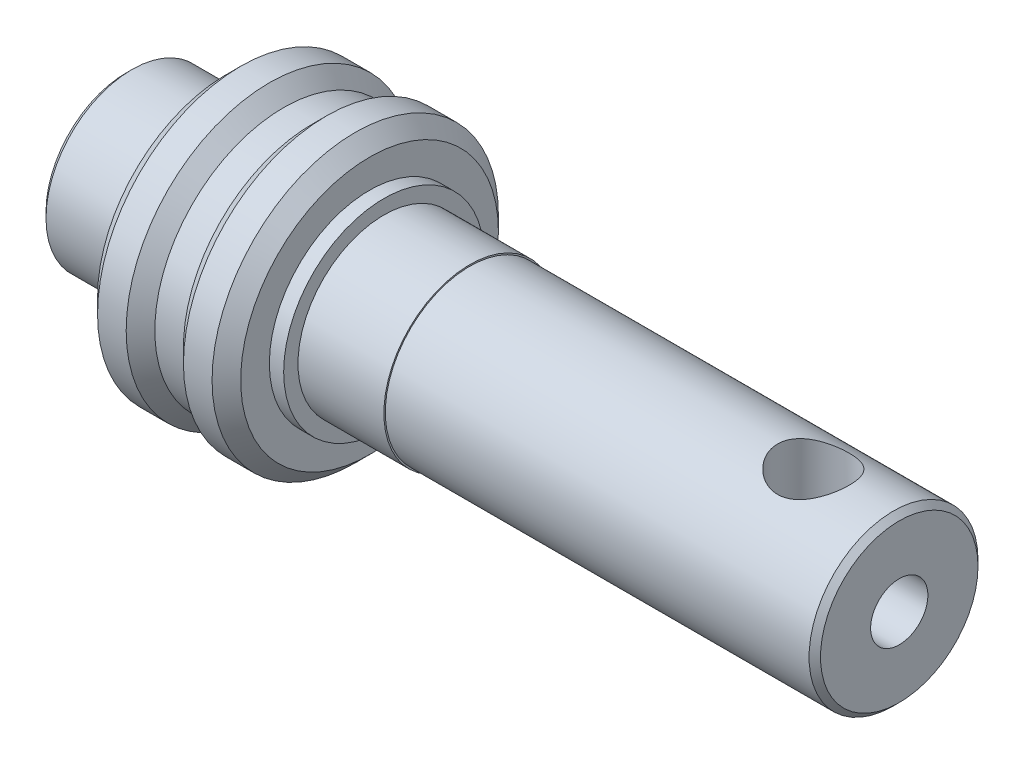
ISO-10303-21;
HEADER;
FILE_DESCRIPTION(('STEP AP214'),'2;1');
FILE_NAME('part.step','',(''),(''),'','','');
FILE_SCHEMA(('AUTOMOTIVE_DESIGN { 1 0 10303 214 1 1 1 1 }'));
ENDSEC;
DATA;
#1=APPLICATION_CONTEXT('core data for automotive mechanical design processes');
#2=APPLICATION_PROTOCOL_DEFINITION('international standard','automotive_design',2000,#1);
#3=PRODUCT_CONTEXT('',#1,'mechanical');
#4=PRODUCT('Part','Part','',(#3));
#5=PRODUCT_RELATED_PRODUCT_CATEGORY('part','',(#4));
#6=PRODUCT_DEFINITION_FORMATION('','',#4);
#7=PRODUCT_DEFINITION_CONTEXT('part definition',#1,'design');
#8=PRODUCT_DEFINITION('design','',#6,#7);
#9=PRODUCT_DEFINITION_SHAPE('','',#8);
#10=(LENGTH_UNIT() NAMED_UNIT(*) SI_UNIT(.MILLI.,.METRE.));
#11=(NAMED_UNIT(*) PLANE_ANGLE_UNIT() SI_UNIT($,.RADIAN.));
#12=(NAMED_UNIT(*) SI_UNIT($,.STERADIAN.) SOLID_ANGLE_UNIT());
#13=UNCERTAINTY_MEASURE_WITH_UNIT(LENGTH_MEASURE(1.E-05),#10,'distance_accuracy_value','');
#14=(GEOMETRIC_REPRESENTATION_CONTEXT(3) GLOBAL_UNCERTAINTY_ASSIGNED_CONTEXT((#13)) GLOBAL_UNIT_ASSIGNED_CONTEXT((#10,
#11,#12)) REPRESENTATION_CONTEXT('',''));
#15=CARTESIAN_POINT('',(0.,0.,0.));
#16=DIRECTION('',(0.,0.,1.));
#17=DIRECTION('',(1.,0.,0.));
#18=AXIS2_PLACEMENT_3D('',#15,#16,#17);
#19=CARTESIAN_POINT('',(-3.,3.,0.));
#20=DIRECTION('',(-1.,0.,0.));
#21=DIRECTION('',(0.,0.,1.));
#22=AXIS2_PLACEMENT_3D('',#19,#20,#21);
#23=PLANE('',#22);
#24=CARTESIAN_POINT('',(-3.,0.,0.));
#25=DIRECTION('',(1.,0.,0.));
#26=DIRECTION('',(0.,0.,-1.));
#27=AXIS2_PLACEMENT_3D('',#24,#25,#26);
#28=CIRCLE('',#27,3.);
#29=CARTESIAN_POINT('',(-3.,0.,-3.));
#30=VERTEX_POINT('',#29);
#31=EDGE_CURVE('E165',#30,#30,#28,.T.);
#32=ORIENTED_EDGE('',*,*,#31,.T.);
#33=EDGE_LOOP('',(#32));
#34=FACE_BOUND('',#33,.T.);
#35=CARTESIAN_POINT('',(-3.,0.,0.));
#36=DIRECTION('',(1.,0.,0.));
#37=DIRECTION('',(0.,0.,-1.));
#38=AXIS2_PLACEMENT_3D('',#35,#36,#37);
#39=CIRCLE('',#38,3.5);
#40=CARTESIAN_POINT('',(-3.,0.,-3.5));
#41=VERTEX_POINT('',#40);
#42=EDGE_CURVE('E126',#41,#41,#39,.T.);
#43=ORIENTED_EDGE('',*,*,#42,.F.);
#44=EDGE_LOOP('',(#43));
#45=FACE_BOUND('',#44,.T.);
#46=ADVANCED_FACE('F37',(#34,#45),#23,.T.);
#47=CARTESIAN_POINT('',(-5.51877622836158,0.,0.));
#48=DIRECTION('',(1.,0.,0.));
#49=DIRECTION('',(0.,0.,-1.));
#50=AXIS2_PLACEMENT_3D('',#47,#48,#49);
#51=CYLINDRICAL_SURFACE('',#50,3.5);
#52=ORIENTED_EDGE('',*,*,#42,.T.);
#53=EDGE_LOOP('',(#52));
#54=FACE_BOUND('',#53,.T.);
#55=CARTESIAN_POINT('',(-2.5,0.,0.));
#56=DIRECTION('',(1.,0.,0.));
#57=DIRECTION('',(0.,0.,-1.));
#58=AXIS2_PLACEMENT_3D('',#55,#56,#57);
#59=CIRCLE('',#58,3.5);
#60=CARTESIAN_POINT('',(-2.5,0.,-3.5));
#61=VERTEX_POINT('',#60);
#62=EDGE_CURVE('E129',#61,#61,#59,.T.);
#63=ORIENTED_EDGE('',*,*,#62,.F.);
#64=EDGE_LOOP('',(#63));
#65=FACE_BOUND('',#64,.T.);
#66=ADVANCED_FACE('F222',(#54,#65),#51,.T.);
#67=CARTESIAN_POINT('',(-2.5,3.5,0.));
#68=DIRECTION('',(-1.,0.,0.));
#69=DIRECTION('',(0.,0.,1.));
#70=AXIS2_PLACEMENT_3D('',#67,#68,#69);
#71=PLANE('',#70);
#72=CARTESIAN_POINT('',(-2.5,0.,0.));
#73=DIRECTION('',(-1.,0.,0.));
#74=DIRECTION('',(0.,0.,1.));
#75=AXIS2_PLACEMENT_3D('',#72,#73,#74);
#76=CIRCLE('',#75,4.5);
#77=CARTESIAN_POINT('',(-2.5,0.,4.5));
#78=VERTEX_POINT('',#77);
#79=EDGE_CURVE('E111',#78,#78,#76,.T.);
#80=ORIENTED_EDGE('',*,*,#79,.T.);
#81=EDGE_LOOP('',(#80));
#82=FACE_BOUND('',#81,.T.);
#83=ORIENTED_EDGE('',*,*,#62,.T.);
#84=EDGE_LOOP('',(#83));
#85=FACE_BOUND('',#84,.T.);
#86=ADVANCED_FACE('F218',(#82,#85),#71,.T.);
#87=CARTESIAN_POINT('',(-5.51877622836158,0.,0.));
#88=DIRECTION('',(1.,0.,0.));
#89=DIRECTION('',(0.,0.,-1.));
#90=AXIS2_PLACEMENT_3D('',#87,#88,#89);
#91=CYLINDRICAL_SURFACE('',#90,5.);
#92=CARTESIAN_POINT('',(-2.,0.,0.));
#93=DIRECTION('',(-1.,0.,0.));
#94=DIRECTION('',(0.,0.,1.));
#95=AXIS2_PLACEMENT_3D('',#92,#93,#94);
#96=CIRCLE('',#95,5.);
#97=CARTESIAN_POINT('',(-2.,0.,5.));
#98=VERTEX_POINT('',#97);
#99=EDGE_CURVE('E117',#98,#98,#96,.F.);
#100=ORIENTED_EDGE('',*,*,#99,.T.);
#101=EDGE_LOOP('',(#100));
#102=FACE_BOUND('',#101,.T.);
#103=CARTESIAN_POINT('',(-1.,0.,0.));
#104=DIRECTION('',(1.,0.,0.));
#105=DIRECTION('',(0.,0.,-1.));
#106=AXIS2_PLACEMENT_3D('',#103,#104,#105);
#107=CIRCLE('',#106,5.);
#108=CARTESIAN_POINT('',(-1.,0.,-5.));
#109=VERTEX_POINT('',#108);
#110=EDGE_CURVE('E132',#109,#109,#107,.T.);
#111=ORIENTED_EDGE('',*,*,#110,.F.);
#112=EDGE_LOOP('',(#111));
#113=FACE_BOUND('',#112,.T.);
#114=ADVANCED_FACE('F214',(#102,#113),#91,.T.);
#115=CARTESIAN_POINT('',(-0.5,0.,0.));
#116=DIRECTION('',(-1.,0.,0.));
#117=DIRECTION('',(0.,0.,1.));
#118=AXIS2_PLACEMENT_3D('',#115,#116,#117);
#119=CONICAL_SURFACE('',#118,4.5,0.785398163397448);
#120=ORIENTED_EDGE('',*,*,#110,.T.);
#121=EDGE_LOOP('',(#120));
#122=FACE_BOUND('',#121,.T.);
#123=CARTESIAN_POINT('',(-0.5,0.,0.));
#124=DIRECTION('',(1.,0.,0.));
#125=DIRECTION('',(0.,0.,-1.));
#126=AXIS2_PLACEMENT_3D('',#123,#124,#125);
#127=CIRCLE('',#126,4.5);
#128=CARTESIAN_POINT('',(-0.5,0.,-4.5));
#129=VERTEX_POINT('',#128);
#130=EDGE_CURVE('E135',#129,#129,#127,.T.);
#131=ORIENTED_EDGE('',*,*,#130,.F.);
#132=EDGE_LOOP('',(#131));
#133=FACE_BOUND('',#132,.T.);
#134=ADVANCED_FACE('F210',(#122,#133),#119,.T.);
#135=CARTESIAN_POINT('',(-5.51877622836158,0.,0.));
#136=DIRECTION('',(1.,0.,0.));
#137=DIRECTION('',(0.,0.,-1.));
#138=AXIS2_PLACEMENT_3D('',#135,#136,#137);
#139=CYLINDRICAL_SURFACE('',#138,4.5);
#140=ORIENTED_EDGE('',*,*,#130,.T.);
#141=EDGE_LOOP('',(#140));
#142=FACE_BOUND('',#141,.T.);
#143=CARTESIAN_POINT('',(0.5,0.,0.));
#144=DIRECTION('',(1.,0.,0.));
#145=DIRECTION('',(0.,0.,-1.));
#146=AXIS2_PLACEMENT_3D('',#143,#144,#145);
#147=CIRCLE('',#146,4.5);
#148=CARTESIAN_POINT('',(0.5,0.,-4.5));
#149=VERTEX_POINT('',#148);
#150=EDGE_CURVE('E138',#149,#149,#147,.T.);
#151=ORIENTED_EDGE('',*,*,#150,.F.);
#152=EDGE_LOOP('',(#151));
#153=FACE_BOUND('',#152,.T.);
#154=ADVANCED_FACE('F206',(#142,#153),#139,.T.);
#155=CARTESIAN_POINT('',(1.,0.,0.));
#156=DIRECTION('',(1.,0.,0.));
#157=DIRECTION('',(0.,0.,-1.));
#158=AXIS2_PLACEMENT_3D('',#155,#156,#157);
#159=CONICAL_SURFACE('',#158,5.,0.785398163397448);
#160=ORIENTED_EDGE('',*,*,#150,.T.);
#161=EDGE_LOOP('',(#160));
#162=FACE_BOUND('',#161,.T.);
#163=CARTESIAN_POINT('',(1.,0.,0.));
#164=DIRECTION('',(1.,0.,0.));
#165=DIRECTION('',(0.,0.,-1.));
#166=AXIS2_PLACEMENT_3D('',#163,#164,#165);
#167=CIRCLE('',#166,5.);
#168=CARTESIAN_POINT('',(1.,0.,-5.));
#169=VERTEX_POINT('',#168);
#170=EDGE_CURVE('E141',#169,#169,#167,.T.);
#171=ORIENTED_EDGE('',*,*,#170,.F.);
#172=EDGE_LOOP('',(#171));
#173=FACE_BOUND('',#172,.T.);
#174=ADVANCED_FACE('F202',(#162,#173),#159,.T.);
#175=CARTESIAN_POINT('',(-5.51877622836158,0.,0.));
#176=DIRECTION('',(1.,0.,0.));
#177=DIRECTION('',(0.,0.,-1.));
#178=AXIS2_PLACEMENT_3D('',#175,#176,#177);
#179=CYLINDRICAL_SURFACE('',#178,5.);
#180=CARTESIAN_POINT('',(2.,0.,0.));
#181=DIRECTION('',(1.,0.,0.));
#182=DIRECTION('',(0.,0.,-1.));
#183=AXIS2_PLACEMENT_3D('',#180,#181,#182);
#184=CIRCLE('',#183,5.);
#185=CARTESIAN_POINT('',(2.,0.,-5.));
#186=VERTEX_POINT('',#185);
#187=EDGE_CURVE('E120',#186,#186,#184,.F.);
#188=ORIENTED_EDGE('',*,*,#187,.T.);
#189=EDGE_LOOP('',(#188));
#190=FACE_BOUND('',#189,.T.);
#191=ORIENTED_EDGE('',*,*,#170,.T.);
#192=EDGE_LOOP('',(#191));
#193=FACE_BOUND('',#192,.T.);
#194=ADVANCED_FACE('F198',(#190,#193),#179,.T.);
#195=CARTESIAN_POINT('',(2.5,3.5,0.));
#196=DIRECTION('',(1.,0.,0.));
#197=DIRECTION('',(0.,0.,-1.));
#198=AXIS2_PLACEMENT_3D('',#195,#196,#197);
#199=PLANE('',#198);
#200=CARTESIAN_POINT('',(2.5,0.,0.));
#201=DIRECTION('',(1.,0.,0.));
#202=DIRECTION('',(0.,0.,-1.));
#203=AXIS2_PLACEMENT_3D('',#200,#201,#202);
#204=CIRCLE('',#203,4.5);
#205=CARTESIAN_POINT('',(2.5,0.,-4.5));
#206=VERTEX_POINT('',#205);
#207=EDGE_CURVE('E123',#206,#206,#204,.T.);
#208=ORIENTED_EDGE('',*,*,#207,.T.);
#209=EDGE_LOOP('',(#208));
#210=FACE_BOUND('',#209,.T.);
#211=CARTESIAN_POINT('',(2.5,0.,0.));
#212=DIRECTION('',(1.,0.,0.));
#213=DIRECTION('',(0.,0.,-1.));
#214=AXIS2_PLACEMENT_3D('',#211,#212,#213);
#215=CIRCLE('',#214,3.5);
#216=CARTESIAN_POINT('',(2.5,0.,-3.5));
#217=VERTEX_POINT('',#216);
#218=EDGE_CURVE('E144',#217,#217,#215,.T.);
#219=ORIENTED_EDGE('',*,*,#218,.F.);
#220=EDGE_LOOP('',(#219));
#221=FACE_BOUND('',#220,.T.);
#222=ADVANCED_FACE('F194',(#210,#221),#199,.T.);
#223=CARTESIAN_POINT('',(-5.51877622836158,0.,0.));
#224=DIRECTION('',(1.,0.,0.));
#225=DIRECTION('',(0.,0.,-1.));
#226=AXIS2_PLACEMENT_3D('',#223,#224,#225);
#227=CYLINDRICAL_SURFACE('',#226,3.5);
#228=ORIENTED_EDGE('',*,*,#218,.T.);
#229=EDGE_LOOP('',(#228));
#230=FACE_BOUND('',#229,.T.);
#231=CARTESIAN_POINT('',(3.,0.,0.));
#232=DIRECTION('',(1.,0.,0.));
#233=DIRECTION('',(0.,0.,-1.));
#234=AXIS2_PLACEMENT_3D('',#231,#232,#233);
#235=CIRCLE('',#234,3.5);
#236=CARTESIAN_POINT('',(3.,0.,-3.5));
#237=VERTEX_POINT('',#236);
#238=EDGE_CURVE('E147',#237,#237,#235,.T.);
#239=ORIENTED_EDGE('',*,*,#238,.F.);
#240=EDGE_LOOP('',(#239));
#241=FACE_BOUND('',#240,.T.);
#242=ADVANCED_FACE('F190',(#230,#241),#227,.T.);
#243=CARTESIAN_POINT('',(3.,3.,0.));
#244=DIRECTION('',(1.,0.,0.));
#245=DIRECTION('',(0.,0.,-1.));
#246=AXIS2_PLACEMENT_3D('',#243,#244,#245);
#247=PLANE('',#246);
#248=ORIENTED_EDGE('',*,*,#238,.T.);
#249=EDGE_LOOP('',(#248));
#250=FACE_BOUND('',#249,.T.);
#251=CARTESIAN_POINT('',(3.,0.,0.));
#252=DIRECTION('',(1.,0.,0.));
#253=DIRECTION('',(0.,0.,-1.));
#254=AXIS2_PLACEMENT_3D('',#251,#252,#253);
#255=CIRCLE('',#254,3.);
#256=CARTESIAN_POINT('',(3.,0.,-3.));
#257=VERTEX_POINT('',#256);
#258=EDGE_CURVE('E150',#257,#257,#255,.T.);
#259=ORIENTED_EDGE('',*,*,#258,.F.);
#260=EDGE_LOOP('',(#259));
#261=FACE_BOUND('',#260,.T.);
#262=ADVANCED_FACE('F186',(#250,#261),#247,.T.);
#263=CARTESIAN_POINT('',(-5.51877622836158,0.,0.));
#264=DIRECTION('',(1.,0.,0.));
#265=DIRECTION('',(0.,0.,-1.));
#266=AXIS2_PLACEMENT_3D('',#263,#264,#265);
#267=CYLINDRICAL_SURFACE('',#266,3.);
#268=ORIENTED_EDGE('',*,*,#258,.T.);
#269=EDGE_LOOP('',(#268));
#270=FACE_BOUND('',#269,.T.);
#271=CARTESIAN_POINT('',(6.,0.,0.));
#272=DIRECTION('',(1.,0.,0.));
#273=DIRECTION('',(0.,0.,-1.));
#274=AXIS2_PLACEMENT_3D('',#271,#272,#273);
#275=CIRCLE('',#274,3.);
#276=CARTESIAN_POINT('',(6.,0.,-3.));
#277=VERTEX_POINT('',#276);
#278=EDGE_CURVE('E153',#277,#277,#275,.T.);
#279=ORIENTED_EDGE('',*,*,#278,.F.);
#280=EDGE_LOOP('',(#279));
#281=FACE_BOUND('',#280,.T.);
#282=ADVANCED_FACE('F182',(#270,#281),#267,.T.);
#283=CARTESIAN_POINT('',(6.,3.,0.));
#284=DIRECTION('',(1.,0.,0.));
#285=DIRECTION('',(0.,0.,-1.));
#286=AXIS2_PLACEMENT_3D('',#283,#284,#285);
#287=PLANE('',#286);
#288=ORIENTED_EDGE('',*,*,#278,.T.);
#289=EDGE_LOOP('',(#288));
#290=FACE_BOUND('',#289,.T.);
#291=CARTESIAN_POINT('',(6.,0.,0.));
#292=DIRECTION('',(1.,0.,0.));
#293=DIRECTION('',(0.,0.,-1.));
#294=AXIS2_PLACEMENT_3D('',#291,#292,#293);
#295=CIRCLE('',#294,2.95);
#296=CARTESIAN_POINT('',(6.,0.,-2.95));
#297=VERTEX_POINT('',#296);
#298=EDGE_CURVE('E156',#297,#297,#295,.T.);
#299=ORIENTED_EDGE('',*,*,#298,.F.);
#300=EDGE_LOOP('',(#299));
#301=FACE_BOUND('',#300,.T.);
#302=ADVANCED_FACE('F178',(#290,#301),#287,.T.);
#303=CARTESIAN_POINT('',(-5.51877622836158,0.,0.));
#304=DIRECTION('',(1.,0.,0.));
#305=DIRECTION('',(0.,0.,-1.));
#306=AXIS2_PLACEMENT_3D('',#303,#304,#305);
#307=CYLINDRICAL_SURFACE('',#306,2.95);
#308=CARTESIAN_POINT('',(20.8,0.,0.));
#309=DIRECTION('',(1.,0.,0.));
#310=DIRECTION('',(0.,0.,-1.));
#311=AXIS2_PLACEMENT_3D('',#308,#309,#310);
#312=CIRCLE('',#311,2.95);
#313=CARTESIAN_POINT('',(20.8,0.,-2.95));
#314=VERTEX_POINT('',#313);
#315=EDGE_CURVE('E82',#314,#314,#312,.F.);
#316=ORIENTED_EDGE('',*,*,#315,.T.);
#317=EDGE_LOOP('',(#316));
#318=FACE_BOUND('',#317,.T.);
#319=CARTESIAN_POINT('',(18.,2.67207784317748,1.25));
#320=CARTESIAN_POINT('',(18.0665552583669,2.67208548535067,1.2499922049137));
#321=CARTESIAN_POINT('',(18.1332143552284,2.67460083245179,1.24465078997766));
#322=CARTESIAN_POINT('',(18.2646017748847,2.68434099538183,1.22349475548766));
#323=CARTESIAN_POINT('',(18.3293244535233,2.69157839586132,1.20765214761075));
#324=CARTESIAN_POINT('',(18.4546979243511,2.70978171460301,1.16622843052234));
#325=CARTESIAN_POINT('',(18.5153644763384,2.72073206042404,1.14068794236819));
#326=CARTESIAN_POINT('',(18.6315348578278,2.74510530380813,1.08071294797428));
#327=CARTESIAN_POINT('',(18.6870397823873,2.75852767511306,1.04628033411194));
#328=CARTESIAN_POINT('',(18.7949185251702,2.7872988114418,0.967128190521415));
#329=CARTESIAN_POINT('',(18.8469200256668,2.80271430595523,0.921925236300558));
#330=CARTESIAN_POINT('',(18.9428805867829,2.83318723945733,0.823529939056352));
#331=CARTESIAN_POINT('',(18.9868364841508,2.84824453559925,0.770334468556174));
#332=CARTESIAN_POINT('',(19.0673801778458,2.87712035476398,0.654517555720196));
#333=CARTESIAN_POINT('',(19.1035459596839,2.89085231221359,0.591579077109848));
#334=CARTESIAN_POINT('',(19.1646143967269,2.91470979722037,0.459824082234821));
#335=CARTESIAN_POINT('',(19.1895222138995,2.92483697717571,0.391010277150106));
#336=CARTESIAN_POINT('',(19.2260086602687,2.93987005428562,0.253370030703841));
#337=CARTESIAN_POINT('',(19.2382301665857,2.94502671403674,0.184741960276691));
#338=CARTESIAN_POINT('',(19.2510774958484,2.950450589839,0.0462285265928651));
#339=CARTESIAN_POINT('',(19.2517081927168,2.95071986103111,-0.0236562958261174));
#340=CARTESIAN_POINT('',(19.2416860476922,2.94648407675087,-0.158012999343338));
#341=CARTESIAN_POINT('',(19.2317404430642,2.94227826022061,-0.222548862051797));
#342=CARTESIAN_POINT('',(19.2020644877658,2.92997909464513,-0.348934785017122));
#343=CARTESIAN_POINT('',(19.1823334146408,2.92188545856613,-0.410784646601553));
#344=CARTESIAN_POINT('',(19.1334165217714,2.90243404698298,-0.531183115927093));
#345=CARTESIAN_POINT('',(19.1040907245077,2.89102824566175,-0.589666771993098));
#346=CARTESIAN_POINT('',(19.0369568874454,2.86606172043506,-0.701036573450896));
#347=CARTESIAN_POINT('',(18.9991458189152,2.85250022758277,-0.753920710206181));
#348=CARTESIAN_POINT('',(18.9129275966787,2.82341527980689,-0.856668382156696));
#349=CARTESIAN_POINT('',(18.8639507332495,2.8078208654667,-0.906034453762614));
#350=CARTESIAN_POINT('',(18.7583903834587,2.77715815894928,-0.996072089759583));
#351=CARTESIAN_POINT('',(18.70180377389,2.76209008600989,-1.03674006641414));
#352=CARTESIAN_POINT('',(18.5801375697692,2.73366918745537,-1.10956655336745));
#353=CARTESIAN_POINT('',(18.5148301733271,2.72039477203299,-1.14137774966339));
#354=CARTESIAN_POINT('',(18.3790739590318,2.69800578399533,-1.19334609168722));
#355=CARTESIAN_POINT('',(18.3086290075598,2.6888881198425,-1.21351190152856));
#356=CARTESIAN_POINT('',(18.1695884325072,2.67661922069407,-1.24032829689829));
#357=CARTESIAN_POINT('',(18.1011808244416,2.67311187366277,-1.24778770337611));
#358=CARTESIAN_POINT('',(17.9640161040773,2.67144148789443,-1.2513620247367));
#359=CARTESIAN_POINT('',(17.8952591289519,2.67327649239418,-1.24748109328585));
#360=CARTESIAN_POINT('',(17.7642207817356,2.68171511685599,-1.22922365861625));
#361=CARTESIAN_POINT('',(17.7018147611092,2.68798996937048,-1.21557004917217));
#362=CARTESIAN_POINT('',(17.580235319636,2.70417583747824,-1.17912156239001));
#363=CARTESIAN_POINT('',(17.521062675582,2.71408772246522,-1.15632449928582));
#364=CARTESIAN_POINT('',(17.4047807878813,2.73694942917907,-1.10115090717702));
#365=CARTESIAN_POINT('',(17.3478699417011,2.75001163483625,-1.0684043349607));
#366=CARTESIAN_POINT('',(17.2400715814243,2.77754742295918,-0.994625199744154));
#367=CARTESIAN_POINT('',(17.1891867520393,2.79202162930138,-0.953588965398221));
#368=CARTESIAN_POINT('',(17.0903947099677,2.8222303185641,-0.860299187462321));
#369=CARTESIAN_POINT('',(17.0431052438998,2.83796765727313,-0.807389755242747));
#370=CARTESIAN_POINT('',(16.9579585708419,2.86779660988328,-0.694027617496358));
#371=CARTESIAN_POINT('',(16.920102201652,2.88188807754742,-0.633574242669689));
#372=CARTESIAN_POINT('',(16.8548892547958,2.90695144238243,-0.506310415126907));
#373=CARTESIAN_POINT('',(16.8275744033031,2.91791089870723,-0.439475979640258));
#374=CARTESIAN_POINT('',(16.784781709034,2.93536539250821,-0.301575081448981));
#375=CARTESIAN_POINT('',(16.7692965536228,2.94186318774924,-0.23051126251259));
#376=CARTESIAN_POINT('',(16.7515464562631,2.94933522185492,-0.0916803580334515));
#377=CARTESIAN_POINT('',(16.7484114348714,2.95067284567154,-0.0240433567641549));
#378=CARTESIAN_POINT('',(16.7530934312401,2.94868965670047,0.110773206146074));
#379=CARTESIAN_POINT('',(16.7609084109025,2.94536971081511,0.177952850575297));
#380=CARTESIAN_POINT('',(16.7866439055202,2.93463872479055,0.307337230514564));
#381=CARTESIAN_POINT('',(16.8041732048366,2.92738628418558,0.3696340452496));
#382=CARTESIAN_POINT('',(16.8484053838091,2.90959814984794,0.490373349143148));
#383=CARTESIAN_POINT('',(16.8751099745739,2.89906184373817,0.548815116945391));
#384=CARTESIAN_POINT('',(16.9382877097247,2.87512451324574,0.663116742678407));
#385=CARTESIAN_POINT('',(16.9751498692132,2.86161500083958,0.718738316430237));
#386=CARTESIAN_POINT('',(17.0570381344835,2.83331994648775,0.823246103047827));
#387=CARTESIAN_POINT('',(17.1020673922224,2.8185339130483,0.872129702639327));
#388=CARTESIAN_POINT('',(17.2027640697753,2.78803240503419,0.965375535968989));
#389=CARTESIAN_POINT('',(17.2589587904109,2.77232519789496,1.00917306547442));
#390=CARTESIAN_POINT('',(17.3783750162311,2.74282295803936,1.08680900592396));
#391=CARTESIAN_POINT('',(17.4416005105312,2.72902902094945,1.1206417229133));
#392=CARTESIAN_POINT('',(17.5732936894461,2.70516212116724,1.17708902916739));
#393=CARTESIAN_POINT('',(17.6417431921724,2.69507690502312,1.19974064678242));
#394=CARTESIAN_POINT('',(17.7819234520298,2.68006586894618,1.23292045956855));
#395=CARTESIAN_POINT('',(17.853642353606,2.67512274869937,1.24348931851437));
#396=CARTESIAN_POINT('',(17.9504276072093,2.67242015313746,1.24926564101883));
#397=CARTESIAN_POINT('',(17.9752065985735,2.67207499628796,1.25000290385325));
#398=CARTESIAN_POINT('',(18.,2.67207784317748,1.25));
#399=B_SPLINE_CURVE_WITH_KNOTS('',3,(#319,#320,#321,#322,#323,#324,#325,#326,#327,#328,#329,
#330,#331,#332,#333,#334,#335,#336,#337,#338,#339,#340,#341,#342,#343,#344,#345,#346,#347,#348,
#349,#350,#351,#352,#353,#354,#355,#356,#357,#358,#359,#360,#361,#362,#363,#364,#365,#366,#367,
#368,#369,#370,#371,#372,#373,#374,#375,#376,#377,#378,#379,#380,#381,#382,#383,#384,#385,#386,
#387,#388,#389,#390,#391,#392,#393,#394,#395,#396,#397,#398),.UNSPECIFIED.,.T.,.F.,(4,2,2,2,2,2,
2,2,2,2,2,2,2,2,2,2,2,2,2,2,2,2,2,2,2,2,2,2,2,2,2,2,2,2,2,2,2,2,2,4),(0.,0.199592817873458,
0.399719751423505,0.599017508057872,0.798272886049059,1.00916805741313,1.22014596815785,
1.44064468608313,1.6610421987841,1.86962657420134,2.07812323810818,2.27350549958668,
2.46890218815728,2.66728709375801,2.86574292378702,3.07859604061582,3.2915367851856,
3.51192416247618,3.73214736063055,3.9377412291607,4.1432598035249,4.33496630435496,
4.52671866045757,4.72672336400251,4.92681684108529,5.14386669054266,5.36093581040808,
5.57885554516475,5.79664046159456,5.99877459978477,6.20087112022192,6.39536505042737,
6.58989527169389,6.79327214091724,6.9967276677592,7.21457994416996,7.43255646227051,
7.64980618356373,7.86632259194709,7.94067561794103),.UNSPECIFIED.);
#400=CARTESIAN_POINT('',(18.,2.67207784317748,1.25));
#401=VERTEX_POINT('',#400);
#402=EDGE_CURVE('E168',#401,#401,#399,.T.);
#403=ORIENTED_EDGE('',*,*,#402,.F.);
#404=EDGE_LOOP('',(#403));
#405=FACE_BOUND('',#404,.T.);
#406=ORIENTED_EDGE('',*,*,#298,.T.);
#407=EDGE_LOOP('',(#406));
#408=FACE_BOUND('',#407,.T.);
#409=ADVANCED_FACE('F173',(#318,#405,#408),#307,.T.);
#410=CARTESIAN_POINT('',(21.,1.,0.));
#411=DIRECTION('',(1.,0.,0.));
#412=DIRECTION('',(0.,0.,-1.));
#413=AXIS2_PLACEMENT_3D('',#410,#411,#412);
#414=PLANE('',#413);
#415=CARTESIAN_POINT('',(21.,0.,0.));
#416=DIRECTION('',(1.,0.,0.));
#417=DIRECTION('',(0.,0.,-1.));
#418=AXIS2_PLACEMENT_3D('',#415,#416,#417);
#419=CIRCLE('',#418,2.75);
#420=CARTESIAN_POINT('',(21.,0.,-2.75));
#421=VERTEX_POINT('',#420);
#422=EDGE_CURVE('E79',#421,#421,#419,.T.);
#423=ORIENTED_EDGE('',*,*,#422,.T.);
#424=EDGE_LOOP('',(#423));
#425=FACE_BOUND('',#424,.T.);
#426=CARTESIAN_POINT('',(21.,0.,0.));
#427=DIRECTION('',(1.,0.,0.));
#428=DIRECTION('',(0.,0.,-1.));
#429=AXIS2_PLACEMENT_3D('',#426,#427,#428);
#430=CIRCLE('',#429,1.);
#431=CARTESIAN_POINT('',(21.,0.,-1.));
#432=VERTEX_POINT('',#431);
#433=EDGE_CURVE('E159',#432,#432,#430,.T.);
#434=ORIENTED_EDGE('',*,*,#433,.F.);
#435=EDGE_LOOP('',(#434));
#436=FACE_BOUND('',#435,.T.);
#437=ADVANCED_FACE('F177',(#425,#436),#414,.T.);
#438=CARTESIAN_POINT('',(-5.51877622836158,0.,0.));
#439=DIRECTION('',(1.,0.,0.));
#440=DIRECTION('',(0.,0.,-1.));
#441=AXIS2_PLACEMENT_3D('',#438,#439,#440);
#442=CYLINDRICAL_SURFACE('',#441,1.);
#443=CARTESIAN_POINT('',(19.5756030700548,0.350290673941371,0.936641043169529));
#444=CARTESIAN_POINT('',(19.5246396434479,0.32668170406506,0.945466151688515));
#445=CARTESIAN_POINT('',(19.473455369953,0.303182341295168,0.953239982626992));
#446=CARTESIAN_POINT('',(19.3706571841348,0.256560629339556,0.966834965593444));
#447=CARTESIAN_POINT('',(19.319043274274,0.233438277995234,0.972656128805282));
#448=CARTESIAN_POINT('',(19.1614761169777,0.163947690562688,0.987614751046838));
#449=CARTESIAN_POINT('',(19.0548614138653,0.118424985067185,0.993900701549579));
#450=CARTESIAN_POINT('',(18.8835575962082,0.049811353605428,0.999087852345102));
#451=CARTESIAN_POINT('',(18.8195410096104,0.025156167205883,0.999957175040698));
#452=CARTESIAN_POINT('',(18.6904923876424,-0.0215328154497545,1.00003954199729));
#453=CARTESIAN_POINT('',(18.6254597109273,-0.0435648736010328,0.999251494454835));
#454=CARTESIAN_POINT('',(18.4950544640566,-0.0832225582826041,0.996725723943276));
#455=CARTESIAN_POINT('',(18.4296996364058,-0.100905971616579,0.995001557393586));
#456=CARTESIAN_POINT('',(18.2976374960253,-0.130078784642128,0.991615170863286));
#457=CARTESIAN_POINT('',(18.2309324059152,-0.141577621077426,0.989952860128547));
#458=CARTESIAN_POINT('',(18.1096539187515,-0.154641300685551,0.987989338894204));
#459=CARTESIAN_POINT('',(18.055252928902,-0.157706667124726,0.987485839786376));
#460=CARTESIAN_POINT('',(17.9464420322991,-0.157767365932568,0.987476472388783));
#461=CARTESIAN_POINT('',(17.8920321251875,-0.154762270995281,0.987970674328208));
#462=CARTESIAN_POINT('',(17.7835325395905,-0.143195129714541,0.989710126335742));
#463=CARTESIAN_POINT('',(17.7294465614238,-0.134600880814346,0.990959725755356));
#464=CARTESIAN_POINT('',(17.6221605409447,-0.113048809059789,0.993648454788972));
#465=CARTESIAN_POINT('',(17.5689610532836,-0.100088354590379,0.995087698386699));
#466=CARTESIAN_POINT('',(17.4372440412977,-0.0638507065843662,0.998193862677072));
#467=CARTESIAN_POINT('',(17.3592599260543,-0.0386451885765358,0.999619493085054));
#468=CARTESIAN_POINT('',(17.2434914920007,0.00216727883110345,1.00009214375334));
#469=CARTESIAN_POINT('',(17.2051473918401,0.0162539317955778,0.999973168858538));
#470=CARTESIAN_POINT('',(17.1287549242809,0.0452298050721487,0.999081545725278));
#471=CARTESIAN_POINT('',(17.0907066578835,0.0601192868031954,0.998308683348215));
#472=CARTESIAN_POINT('',(16.9477762027433,0.117369080848304,0.993980237119599));
#473=CARTESIAN_POINT('',(16.8437544503786,0.161722218216074,0.987920568133422));
#474=CARTESIAN_POINT('',(16.6373379117839,0.252601444257258,0.968692806090757));
#475=CARTESIAN_POINT('',(16.5349428037765,0.299127095813129,0.955526137406145));
#476=CARTESIAN_POINT('',(16.3823672715885,0.369740259250395,0.929476633625827));
#477=CARTESIAN_POINT('',(16.3314981649824,0.39350192208264,0.919697135710341));
#478=CARTESIAN_POINT('',(16.2303064873984,0.441115153252727,0.897832599653712));
#479=CARTESIAN_POINT('',(16.1799838262455,0.464966705854091,0.88574794821599));
#480=CARTESIAN_POINT('',(16.0798992073387,0.512674542477163,0.85902069031459));
#481=CARTESIAN_POINT('',(16.0301384203139,0.536530757909386,0.844373524050662));
#482=CARTESIAN_POINT('',(15.9314338591507,0.584069393329572,0.812205870639943));
#483=CARTESIAN_POINT('',(15.8824905908479,0.607751700979755,0.794683672220996));
#484=CARTESIAN_POINT('',(15.83406802195,0.631264897927152,0.775567294723692));
#485=B_SPLINE_CURVE_WITH_KNOTS('',3,(#443,#444,#445,#446,#447,#448,#449,#450,#451,#452,#453,
#454,#455,#456,#457,#458,#459,#460,#461,#462,#463,#464,#465,#466,#467,#468,#469,#470,#471,#472,
#473,#474,#475,#476,#477,#478,#479,#480,#481,#482,#483,#484),.UNSPECIFIED.,.F.,.F.,(4,2,2,2,2,2,
2,2,2,2,2,2,2,2,2,2,2,2,2,2,4),(0.,0.17053717561642,0.341073374468199,0.689050331301692,
0.894816374179046,1.10071800923619,1.30371445588287,1.50640027505339,1.6695386300726,
1.83268846896681,1.99678674347149,2.16098410135638,2.40664266174327,2.5291859860039,
2.65176945695456,2.99124446654784,3.33065146442933,3.50158228627905,3.67248445862943,
3.84369389027758,4.01500560109968),.UNSPECIFIED.);
#486=CARTESIAN_POINT('',(18.75,0.,1.));
#487=VERTEX_POINT('',#486);
#488=CARTESIAN_POINT('',(17.25,0.,1.));
#489=VERTEX_POINT('',#488);
#490=EDGE_CURVE('E58',#487,#489,#485,.T.);
#491=ORIENTED_EDGE('',*,*,#490,.F.);
#492=CARTESIAN_POINT('',(18.75,0.,-1.));
#493=CARTESIAN_POINT('',(18.749870676237,0.0380129766276095,-1.00004239994648));
#494=CARTESIAN_POINT('',(18.7528910300499,0.0758275155938799,-0.997836474983588));
#495=CARTESIAN_POINT('',(18.7639745958432,0.149745040245508,-0.989402301671298));
#496=CARTESIAN_POINT('',(18.7719684386007,0.185864339148891,-0.983229346307379));
#497=CARTESIAN_POINT('',(18.7953450153432,0.268707378731976,-0.964471732244663));
#498=CARTESIAN_POINT('',(18.8123469035417,0.314612386155177,-0.950384680660609));
#499=CARTESIAN_POINT('',(18.8503794227248,0.402784905806842,-0.916522193316678));
#500=CARTESIAN_POINT('',(18.8714392278384,0.44502265217102,-0.896705010558025));
#501=CARTESIAN_POINT('',(18.9231392119429,0.540201153030469,-0.843872960776306));
#502=CARTESIAN_POINT('',(18.9545040233684,0.591538827620782,-0.808674279042955));
#503=CARTESIAN_POINT('',(19.0164732592259,0.687035191040319,-0.729262171177429));
#504=CARTESIAN_POINT('',(19.0470790133239,0.731207314549794,-0.685065973845451));
#505=CARTESIAN_POINT('',(19.0989511161667,0.803549549289897,-0.597383815759069));
#506=CARTESIAN_POINT('',(19.1208692956695,0.833157650129422,-0.555474703797674));
#507=CARTESIAN_POINT('',(19.1608224290201,0.886178594795777,-0.466231173247661));
#508=CARTESIAN_POINT('',(19.1788627012416,0.909599933711894,-0.418904323224977));
#509=CARTESIAN_POINT('',(19.2070783872444,0.945856702533571,-0.327657998123031));
#510=CARTESIAN_POINT('',(19.2180539649432,0.959791646820218,-0.284425664917518));
#511=CARTESIAN_POINT('',(19.2354297300058,0.981749555646115,-0.195592838876207));
#512=CARTESIAN_POINT('',(19.2418325380227,0.989775906479985,-0.149993718545756));
#513=CARTESIAN_POINT('',(19.2495398552349,0.999429061049004,-0.0575240307640933));
#514=CARTESIAN_POINT('',(19.2508266312104,1.00103360560955,-0.0106496069422975));
#515=CARTESIAN_POINT('',(19.2481346573343,0.997667853243523,0.0827084607393301));
#516=CARTESIAN_POINT('',(19.2441556950557,0.992697291068391,0.129192088757807));
#517=CARTESIAN_POINT('',(19.231641974252,0.97696618936472,0.217840752947661));
#518=CARTESIAN_POINT('',(19.2233674212865,0.966536089432262,0.260103069944626));
#519=CARTESIAN_POINT('',(19.2030230469882,0.940653126263297,0.342084024447004));
#520=CARTESIAN_POINT('',(19.1909520867397,0.925198755707237,0.381801894313005));
#521=CARTESIAN_POINT('',(19.1624293218342,0.888197321851621,0.461768671333843));
#522=CARTESIAN_POINT('',(19.1456673064516,0.866206430250132,0.501699422986387));
#523=CARTESIAN_POINT('',(19.1094655527925,0.817724747800803,0.577363035500914));
#524=CARTESIAN_POINT('',(19.0900249544249,0.791232510934537,0.613094541131814));
#525=CARTESIAN_POINT('',(19.0452814520012,0.728488383702327,0.687109623020991));
#526=CARTESIAN_POINT('',(19.0195949170613,0.69134970694935,0.724408177137869));
#527=CARTESIAN_POINT('',(18.9674919383837,0.611920872614315,0.792656695821792));
#528=CARTESIAN_POINT('',(18.9410739134709,0.569618750861446,0.823591452247027));
#529=CARTESIAN_POINT('',(18.8921541823937,0.484296418009536,0.876199052099706));
#530=CARTESIAN_POINT('',(18.8695186441152,0.441724573038851,0.898471959775695));
#531=CARTESIAN_POINT('',(18.8278248098655,0.352614668010071,0.937018513226684));
#532=CARTESIAN_POINT('',(18.8087436145576,0.306105020498246,0.953331263548851));
#533=CARTESIAN_POINT('',(18.7798786578075,0.217142941380144,0.977028295888455));
#534=CARTESIAN_POINT('',(18.7690702558578,0.175326495703562,0.985453607049308));
#535=CARTESIAN_POINT('',(18.7578446458678,0.11084794015544,0.994079660457728));
#536=CARTESIAN_POINT('',(18.7549312250916,0.0888777407057003,0.996287444608611));
#537=CARTESIAN_POINT('',(18.7509969736239,0.044613005187926,0.999252642595956));
#538=CARTESIAN_POINT('',(18.7499813573707,0.0223177446473539,1.00000606057931));
#539=CARTESIAN_POINT('',(18.75,0.,1.00000000000001));
#540=B_SPLINE_CURVE_WITH_KNOTS('',3,(#492,#493,#494,#495,#496,#497,#498,#499,#500,#501,#502,
#503,#504,#505,#506,#507,#508,#509,#510,#511,#512,#513,#514,#515,#516,#517,#518,#519,#520,#521,
#522,#523,#524,#525,#526,#527,#528,#529,#530,#531,#532,#533,#534,#535,#536,#537,#538,#539),
.UNSPECIFIED.,.F.,.F.,(4,2,2,2,2,2,2,2,2,2,2,2,2,2,2,2,2,2,2,2,2,2,2,4),(0.,0.113538161589319,
0.225527159749816,0.377504713372881,0.530618672369759,0.738714715684922,0.946415974333438,
1.11318075129622,1.27971533775769,1.41931198339593,1.55882856189424,1.69882831414268,
1.83883371433993,1.97120612225622,2.10361827960958,2.24879963014769,2.39402770742755,
2.56910640453789,2.74459876318906,2.90345202850739,3.06124350350388,3.19245916340867,
3.25915499815905,3.32603381952746),.UNSPECIFIED.);
#541=CARTESIAN_POINT('',(18.75,0.,-1.));
#542=VERTEX_POINT('',#541);
#543=EDGE_CURVE('E66',#542,#487,#540,.T.);
#544=ORIENTED_EDGE('',*,*,#543,.F.);
#545=CARTESIAN_POINT('',(15.83406802195,0.63126489792715,-0.775567294723694));
#546=CARTESIAN_POINT('',(15.8751748562927,0.611302981132332,-0.791803909804016));
#547=CARTESIAN_POINT('',(15.9166604073396,0.591219006062307,-0.806882475606104));
#548=CARTESIAN_POINT('',(16.000248387192,0.550906573625251,-0.834930291135149));
#549=CARTESIAN_POINT('',(16.0423505524842,0.530678179767391,-0.847900414803031));
#550=CARTESIAN_POINT('',(16.1693070837524,0.469956095165469,-0.883943763430042));
#551=CARTESIAN_POINT('',(16.2549246917355,0.429370355919858,-0.904193240948624));
#552=CARTESIAN_POINT('',(16.4260879752099,0.349321258783202,-0.937990265748253));
#553=CARTESIAN_POINT('',(16.5116093187059,0.309850625921925,-0.951647596102669));
#554=CARTESIAN_POINT('',(16.6838297932586,0.231982145622925,-0.973558171410131));
#555=CARTESIAN_POINT('',(16.7705289762045,0.193584345677666,-0.981811177484774));
#556=CARTESIAN_POINT('',(16.8900754160507,0.142436207773376,-0.98990290627439));
#557=CARTESIAN_POINT('',(16.922412075854,0.128778893729412,-0.991766062183859));
#558=CARTESIAN_POINT('',(16.9873944924609,0.101774256390088,-0.994900806911705));
#559=CARTESIAN_POINT('',(17.0200409665845,0.0884283778908164,-0.996170019465053));
#560=CARTESIAN_POINT('',(17.1162484646492,0.0498800849682092,-0.999079571484153));
#561=CARTESIAN_POINT('',(17.180084962717,0.0252979092089359,-0.99995141376028));
#562=CARTESIAN_POINT('',(17.3087611482927,-0.021269152799576,-1.00004452820666));
#563=CARTESIAN_POINT('',(17.3736015098641,-0.0432521999396913,-0.999264638926302));
#564=CARTESIAN_POINT('',(17.5039931266815,-0.0829594495912002,-0.996749056538147));
#565=CARTESIAN_POINT('',(17.5695338611561,-0.100717819342474,-0.995021433279972));
#566=CARTESIAN_POINT('',(17.7019744987601,-0.130011533836233,-0.991624973963025));
#567=CARTESIAN_POINT('',(17.7688721336331,-0.141556497722161,-0.989956050795082));
#568=CARTESIAN_POINT('',(17.8903570980576,-0.154642542814012,-0.987989139558757));
#569=CARTESIAN_POINT('',(17.944769274778,-0.157707911106762,-0.987485641125385));
#570=CARTESIAN_POINT('',(18.0536029707015,-0.157766159519452,-0.987476665050176));
#571=CARTESIAN_POINT('',(18.1080244903036,-0.154758555046563,-0.987971267051756));
#572=CARTESIAN_POINT('',(18.2165242780286,-0.143186723190644,-0.989711360623351));
#573=CARTESIAN_POINT('',(18.270599104619,-0.134592571557516,-0.9909608934096));
#574=CARTESIAN_POINT('',(18.377863073805,-0.113043197744112,-0.993649024142996));
#575=CARTESIAN_POINT('',(18.4310516833091,-0.100085443510796,-0.995087731565746));
#576=CARTESIAN_POINT('',(18.5627536422584,-0.0638504565236021,-0.998194207862855));
#577=CARTESIAN_POINT('',(18.6407308704429,-0.0386436820722431,-0.999621124816655));
#578=CARTESIAN_POINT('',(18.7950510309101,0.0157501412501259,-1.00024783688722));
#579=CARTESIAN_POINT('',(18.8713972299625,0.0449281567293477,-0.999452608768284));
#580=CARTESIAN_POINT('',(19.000458214814,0.0966432420102163,-0.995550486183257));
#581=CARTESIAN_POINT('',(19.0534420101986,0.118571481026535,-0.993202234003946));
#582=CARTESIAN_POINT('',(19.1589545174424,0.163263176344811,-0.986840501120088));
#583=CARTESIAN_POINT('',(19.2114832407054,0.18602661164191,-0.9828270622682));
#584=CARTESIAN_POINT('',(19.3161991041313,0.232161192042065,-0.972964072827207));
#585=CARTESIAN_POINT('',(19.368385588555,0.255533224496742,-0.967111685599676));
#586=CARTESIAN_POINT('',(19.4723248437596,0.302666934234422,-0.953412352990125));
#587=CARTESIAN_POINT('',(19.5240775684084,0.326428652187131,-0.94556519816798));
#588=CARTESIAN_POINT('',(19.5756030700548,0.350290673941371,-0.936641043169529));
#589=B_SPLINE_CURVE_WITH_KNOTS('',3,(#545,#546,#547,#548,#549,#550,#551,#552,#553,#554,#555,
#556,#557,#558,#559,#560,#561,#562,#563,#564,#565,#566,#567,#568,#569,#570,#571,#572,#573,#574,
#575,#576,#577,#578,#579,#580,#581,#582,#583,#584,#585,#586,#587,#588),.UNSPECIFIED.,.F.,.F.,(4,
2,2,2,2,2,2,2,2,2,2,2,2,2,2,2,2,2,2,2,2,4),(0.,0.145446989175328,0.290833536576308,
0.581208470219477,0.866564748691672,1.15193363944392,1.25738419072016,1.36325309872013,
1.56842204798595,1.77373531411349,1.97732690095785,2.18060238877964,2.34377404082594,
2.50695871366786,2.6710247665423,2.83518618598981,3.08084306515207,3.32595020707853,
3.49809054640325,3.67022655942944,3.84262941230258,4.01505037405215),.UNSPECIFIED.);
#590=CARTESIAN_POINT('',(17.25,0.,-1.));
#591=VERTEX_POINT('',#590);
#592=EDGE_CURVE('E73',#591,#542,#589,.T.);
#593=ORIENTED_EDGE('',*,*,#592,.F.);
#594=CARTESIAN_POINT('',(17.25,0.,1.));
#595=CARTESIAN_POINT('',(17.250129323763,0.03801297662761,1.00004239994648));
#596=CARTESIAN_POINT('',(17.24710896995,0.0758275155938803,0.997836474983588));
#597=CARTESIAN_POINT('',(17.2360254041568,0.149745040245509,0.989402301671298));
#598=CARTESIAN_POINT('',(17.2280315613993,0.185864339148892,0.983229346307379));
#599=CARTESIAN_POINT('',(17.2046549846568,0.268707378731976,0.964471732244663));
#600=CARTESIAN_POINT('',(17.1876530964583,0.314612386155177,0.950384680660609));
#601=CARTESIAN_POINT('',(17.1496205772752,0.402784905806842,0.916522193316679));
#602=CARTESIAN_POINT('',(17.1285607721616,0.44502265217102,0.896705010558024));
#603=CARTESIAN_POINT('',(17.0768607880571,0.54020115303047,0.843872960776306));
#604=CARTESIAN_POINT('',(17.0454959766316,0.591538827620783,0.808674279042955));
#605=CARTESIAN_POINT('',(16.9835267407741,0.68703519104032,0.729262171177428));
#606=CARTESIAN_POINT('',(16.9529209866761,0.731207314549794,0.68506597384545));
#607=CARTESIAN_POINT('',(16.9010488838333,0.803549549289897,0.597383815759068));
#608=CARTESIAN_POINT('',(16.8791307043304,0.833157650129423,0.555474703797673));
#609=CARTESIAN_POINT('',(16.8391775709799,0.886178594795777,0.46623117324766));
#610=CARTESIAN_POINT('',(16.8211372987584,0.909599933711894,0.418904323224976));
#611=CARTESIAN_POINT('',(16.7929216127556,0.945856702533571,0.32765799812303));
#612=CARTESIAN_POINT('',(16.7819460350568,0.959791646820218,0.284425664917517));
#613=CARTESIAN_POINT('',(16.7645702699942,0.981749555646115,0.195592838876206));
#614=CARTESIAN_POINT('',(16.7581674619773,0.989775906479985,0.149993718545755));
#615=CARTESIAN_POINT('',(16.7504601447651,0.999429061049004,0.0575240307640919));
#616=CARTESIAN_POINT('',(16.7491733687896,1.00103360560955,0.0106496069422961));
#617=CARTESIAN_POINT('',(16.7518653426657,0.997667853243523,-0.0827084607393315));
#618=CARTESIAN_POINT('',(16.7558443049443,0.992697291068391,-0.129192088757809));
#619=CARTESIAN_POINT('',(16.768358025748,0.97696618936472,-0.217840752947663));
#620=CARTESIAN_POINT('',(16.7766325787135,0.966536089432262,-0.260103069944627));
#621=CARTESIAN_POINT('',(16.7969769530118,0.940653126263296,-0.342084024447005));
#622=CARTESIAN_POINT('',(16.8090479132603,0.925198755707237,-0.381801894313006));
#623=CARTESIAN_POINT('',(16.8375706781658,0.88819732185162,-0.461768671333843));
#624=CARTESIAN_POINT('',(16.8543326935484,0.866206430250132,-0.501699422986386));
#625=CARTESIAN_POINT('',(16.8905344472075,0.817724747800803,-0.577363035500914));
#626=CARTESIAN_POINT('',(16.9099750455751,0.791232510934536,-0.613094541131814));
#627=CARTESIAN_POINT('',(16.9547185479988,0.728488383702326,-0.687109623020992));
#628=CARTESIAN_POINT('',(16.9804050829387,0.691349706949349,-0.72440817713787));
#629=CARTESIAN_POINT('',(17.0325080616163,0.611920872614314,-0.792656695821793));
#630=CARTESIAN_POINT('',(17.0589260865291,0.569618750861444,-0.823591452247028));
#631=CARTESIAN_POINT('',(17.1078458176063,0.484296418009534,-0.876199052099707));
#632=CARTESIAN_POINT('',(17.1304813558848,0.441724573038848,-0.898471959775696));
#633=CARTESIAN_POINT('',(17.1721751901345,0.352614668010068,-0.937018513226685));
#634=CARTESIAN_POINT('',(17.1912563854424,0.306105020498243,-0.953331263548852));
#635=CARTESIAN_POINT('',(17.2201213421925,0.21714294138014,-0.977028295888455));
#636=CARTESIAN_POINT('',(17.2309297441422,0.175326495703558,-0.985453607049309));
#637=CARTESIAN_POINT('',(17.2421553541322,0.110847940155437,-0.994079660457729));
#638=CARTESIAN_POINT('',(17.2450687749084,0.088877740705698,-0.996287444608611));
#639=CARTESIAN_POINT('',(17.2490030263761,0.0446130051879244,-0.999252642595956));
#640=CARTESIAN_POINT('',(17.2500186426293,0.0223177446473529,-1.00000606057931));
#641=CARTESIAN_POINT('',(17.25,0.,-1.00000000000001));
#642=B_SPLINE_CURVE_WITH_KNOTS('',3,(#594,#595,#596,#597,#598,#599,#600,#601,#602,#603,#604,
#605,#606,#607,#608,#609,#610,#611,#612,#613,#614,#615,#616,#617,#618,#619,#620,#621,#622,#623,
#624,#625,#626,#627,#628,#629,#630,#631,#632,#633,#634,#635,#636,#637,#638,#639,#640,#641),
.UNSPECIFIED.,.F.,.F.,(4,2,2,2,2,2,2,2,2,2,2,2,2,2,2,2,2,2,2,2,2,2,2,4),(0.,0.113538161589319,
0.225527159749816,0.37750471337288,0.53061867236976,0.738714715684922,0.946415974333439,
1.11318075129622,1.27971533775769,1.41931198339593,1.55882856189424,1.69882831414268,
1.83883371433994,1.97120612225622,2.10361827960958,2.24879963014769,2.39402770742755,
2.5691064045379,2.74459876318906,2.90345202850739,3.06124350350388,3.19245916340867,
3.25915499815905,3.32603381952746),.UNSPECIFIED.);
#643=EDGE_CURVE('E72',#489,#591,#642,.T.);
#644=ORIENTED_EDGE('',*,*,#643,.F.);
#645=EDGE_LOOP('',(#491,#544,#593,#644));
#646=FACE_BOUND('',#645,.T.);
#647=ORIENTED_EDGE('',*,*,#433,.T.);
#648=EDGE_LOOP('',(#647));
#649=FACE_BOUND('',#648,.T.);
#650=CARTESIAN_POINT('',(11.,0.,0.));
#651=DIRECTION('',(1.,0.,0.));
#652=DIRECTION('',(0.,0.,-1.));
#653=AXIS2_PLACEMENT_3D('',#650,#651,#652);
#654=CIRCLE('',#653,1.);
#655=CARTESIAN_POINT('',(11.,0.,-1.));
#656=VERTEX_POINT('',#655);
#657=EDGE_CURVE('E162',#656,#656,#654,.T.);
#658=ORIENTED_EDGE('',*,*,#657,.F.);
#659=EDGE_LOOP('',(#658));
#660=FACE_BOUND('',#659,.T.);
#661=ADVANCED_FACE('F77',(#646,#649,#660),#442,.F.);
#662=CARTESIAN_POINT('',(11.,0.,0.));
#663=DIRECTION('',(1.,0.,0.));
#664=DIRECTION('',(0.,0.,-1.));
#665=AXIS2_PLACEMENT_3D('',#662,#663,#664);
#666=PLANE('',#665);
#667=ORIENTED_EDGE('',*,*,#657,.T.);
#668=EDGE_LOOP('',(#667));
#669=FACE_BOUND('',#668,.T.);
#670=ADVANCED_FACE('F256',(#669),#666,.T.);
#671=CARTESIAN_POINT('',(-6.,3.,0.));
#672=DIRECTION('',(-1.,0.,0.));
#673=DIRECTION('',(0.,0.,1.));
#674=AXIS2_PLACEMENT_3D('',#671,#672,#673);
#675=PLANE('',#674);
#676=CARTESIAN_POINT('',(-6.,0.,0.));
#677=DIRECTION('',(-1.,0.,0.));
#678=DIRECTION('',(0.,0.,1.));
#679=AXIS2_PLACEMENT_3D('',#676,#677,#678);
#680=CIRCLE('',#679,2.8);
#681=CARTESIAN_POINT('',(-6.,0.,2.8));
#682=VERTEX_POINT('',#681);
#683=EDGE_CURVE('E11',#682,#682,#680,.T.);
#684=ORIENTED_EDGE('',*,*,#683,.T.);
#685=EDGE_LOOP('',(#684));
#686=FACE_BOUND('',#685,.T.);
#687=ADVANCED_FACE('F260',(#686),#675,.T.);
#688=CARTESIAN_POINT('',(-5.51877622836158,0.,0.));
#689=DIRECTION('',(1.,0.,0.));
#690=DIRECTION('',(0.,0.,-1.));
#691=AXIS2_PLACEMENT_3D('',#688,#689,#690);
#692=CYLINDRICAL_SURFACE('',#691,3.);
#693=CARTESIAN_POINT('',(-5.8,0.,0.));
#694=DIRECTION('',(-1.,0.,0.));
#695=DIRECTION('',(0.,0.,1.));
#696=AXIS2_PLACEMENT_3D('',#693,#694,#695);
#697=CIRCLE('',#696,3.);
#698=CARTESIAN_POINT('',(-5.8,0.,3.));
#699=VERTEX_POINT('',#698);
#700=EDGE_CURVE('E45',#699,#699,#697,.F.);
#701=ORIENTED_EDGE('',*,*,#700,.T.);
#702=EDGE_LOOP('',(#701));
#703=FACE_BOUND('',#702,.T.);
#704=ORIENTED_EDGE('',*,*,#31,.F.);
#705=EDGE_LOOP('',(#704));
#706=FACE_BOUND('',#705,.T.);
#707=ADVANCED_FACE('F103',(#703,#706),#692,.T.);
#708=CARTESIAN_POINT('',(2.5,0.,0.));
#709=DIRECTION('',(-1.,0.,0.));
#710=DIRECTION('',(0.,0.,1.));
#711=AXIS2_PLACEMENT_3D('',#708,#709,#710);
#712=CONICAL_SURFACE('',#711,4.5,0.785398163397444);
#713=ORIENTED_EDGE('',*,*,#187,.F.);
#714=EDGE_LOOP('',(#713));
#715=FACE_BOUND('',#714,.T.);
#716=ORIENTED_EDGE('',*,*,#207,.F.);
#717=EDGE_LOOP('',(#716));
#718=FACE_BOUND('',#717,.T.);
#719=ADVANCED_FACE('F230',(#715,#718),#712,.T.);
#720=CARTESIAN_POINT('',(-2.,0.,0.));
#721=DIRECTION('',(1.,0.,0.));
#722=DIRECTION('',(0.,0.,-1.));
#723=AXIS2_PLACEMENT_3D('',#720,#721,#722);
#724=CONICAL_SURFACE('',#723,5.,0.785398163397448);
#725=ORIENTED_EDGE('',*,*,#79,.F.);
#726=EDGE_LOOP('',(#725));
#727=FACE_BOUND('',#726,.T.);
#728=ORIENTED_EDGE('',*,*,#99,.F.);
#729=EDGE_LOOP('',(#728));
#730=FACE_BOUND('',#729,.T.);
#731=ADVANCED_FACE('F233',(#727,#730),#724,.T.);
#732=CARTESIAN_POINT('',(18.,0.,0.));
#733=DIRECTION('',(0.,1.,0.));
#734=DIRECTION('',(0.,0.,1.));
#735=AXIS2_PLACEMENT_3D('',#732,#733,#734);
#736=CONICAL_SURFACE('',#735,1.25,1.02974425867665);
#737=ORIENTED_EDGE('',*,*,#490,.T.);
#738=CARTESIAN_POINT('',(18.,0.,0.));
#739=DIRECTION('',(0.,1.,0.));
#740=DIRECTION('',(0.,0.,1.));
#741=AXIS2_PLACEMENT_3D('',#738,#739,#740);
#742=CIRCLE('',#741,1.25);
#743=EDGE_CURVE('E68',#489,#487,#742,.T.);
#744=ORIENTED_EDGE('',*,*,#743,.T.);
#745=EDGE_LOOP('',(#737,#744));
#746=FACE_BOUND('',#745,.T.);
#747=ADVANCED_FACE('F75',(#746),#736,.F.);
#748=ORIENTED_EDGE('',*,*,#592,.T.);
#749=EDGE_CURVE('E51',#542,#591,#742,.T.);
#750=ORIENTED_EDGE('',*,*,#749,.T.);
#751=EDGE_LOOP('',(#748,#750));
#752=FACE_BOUND('',#751,.T.);
#753=ADVANCED_FACE('F98',(#752),#736,.F.);
#754=CARTESIAN_POINT('',(18.,3.,0.));
#755=DIRECTION('',(0.,1.,0.));
#756=DIRECTION('',(0.,0.,1.));
#757=AXIS2_PLACEMENT_3D('',#754,#755,#756);
#758=CYLINDRICAL_SURFACE('',#757,1.25);
#759=ORIENTED_EDGE('',*,*,#402,.T.);
#760=EDGE_LOOP('',(#759));
#761=FACE_BOUND('',#760,.T.);
#762=ORIENTED_EDGE('',*,*,#643,.T.);
#763=ORIENTED_EDGE('',*,*,#749,.F.);
#764=ORIENTED_EDGE('',*,*,#543,.T.);
#765=ORIENTED_EDGE('',*,*,#743,.F.);
#766=EDGE_LOOP('',(#762,#763,#764,#765));
#767=FACE_BOUND('',#766,.T.);
#768=ADVANCED_FACE('F67',(#761,#767),#758,.F.);
#769=CARTESIAN_POINT('',(21.,0.,0.));
#770=DIRECTION('',(-1.,0.,0.));
#771=DIRECTION('',(0.,0.,1.));
#772=AXIS2_PLACEMENT_3D('',#769,#770,#771);
#773=CONICAL_SURFACE('',#772,2.75,0.785398163397449);
#774=ORIENTED_EDGE('',*,*,#315,.F.);
#775=EDGE_LOOP('',(#774));
#776=FACE_BOUND('',#775,.T.);
#777=ORIENTED_EDGE('',*,*,#422,.F.);
#778=EDGE_LOOP('',(#777));
#779=FACE_BOUND('',#778,.T.);
#780=ADVANCED_FACE('F237',(#776,#779),#773,.T.);
#781=CARTESIAN_POINT('',(-5.8,0.,0.));
#782=DIRECTION('',(1.,0.,0.));
#783=DIRECTION('',(0.,0.,-1.));
#784=AXIS2_PLACEMENT_3D('',#781,#782,#783);
#785=CONICAL_SURFACE('',#784,3.,0.785398163397446);
#786=ORIENTED_EDGE('',*,*,#683,.F.);
#787=EDGE_LOOP('',(#786));
#788=FACE_BOUND('',#787,.T.);
#789=ORIENTED_EDGE('',*,*,#700,.F.);
#790=EDGE_LOOP('',(#789));
#791=FACE_BOUND('',#790,.T.);
#792=ADVANCED_FACE('F39',(#788,#791),#785,.T.);
#793=CLOSED_SHELL('',(#46,#66,#86,#114,#134,#154,#174,#194,#222,#242,#262,#282,#302,#409,#437,
#661,#670,#687,#707,#719,#731,#747,#753,#768,#780,#792));
#794=MANIFOLD_SOLID_BREP('B2',#793);
#795=ADVANCED_BREP_SHAPE_REPRESENTATION('',(#18,#794),#14);
#796=SHAPE_DEFINITION_REPRESENTATION(#9,#795);
ENDSEC;
END-ISO-10303-21;
